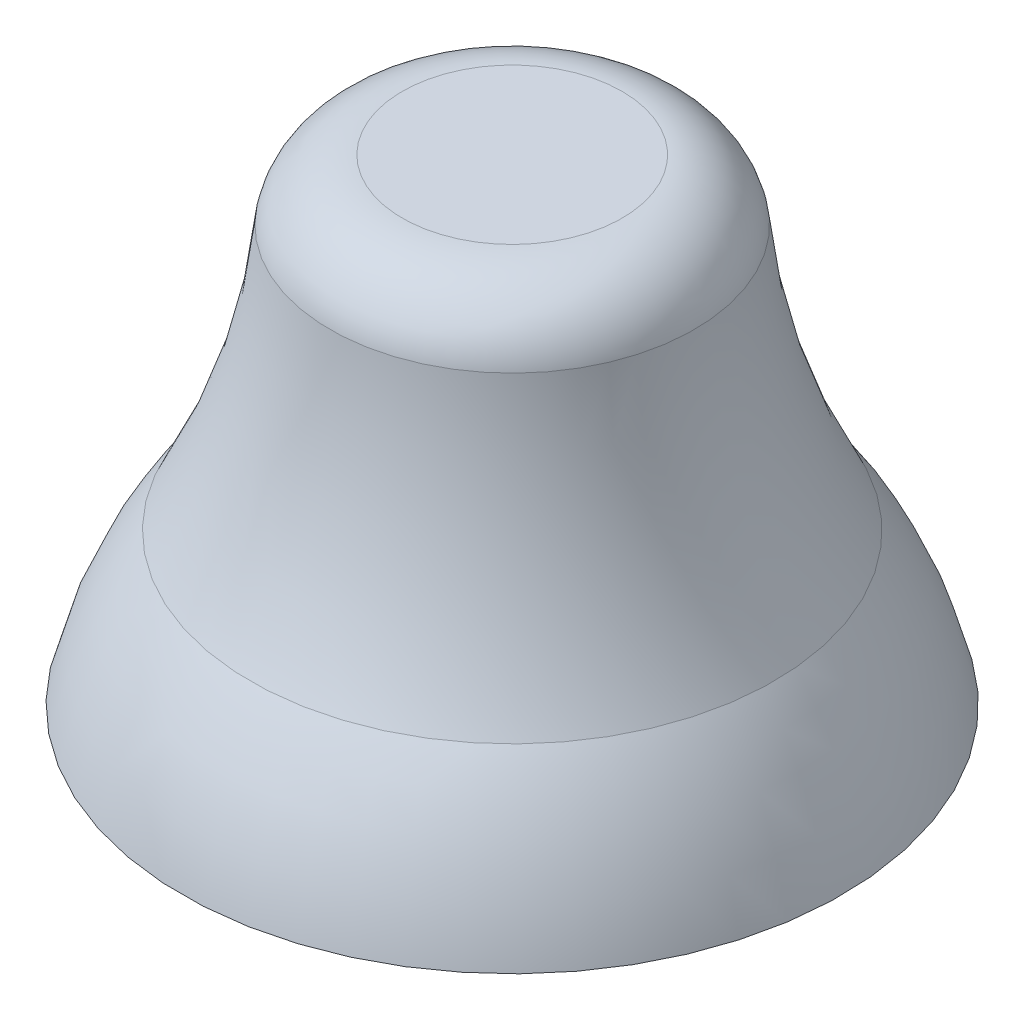
ISO-10303-21;
HEADER;
FILE_DESCRIPTION(('STEP AP214'),'2;1');
FILE_NAME('part.step','',(''),(''),'','','');
FILE_SCHEMA(('AUTOMOTIVE_DESIGN { 1 0 10303 214 1 1 1 1 }'));
ENDSEC;
DATA;
#1=APPLICATION_CONTEXT('core data for automotive mechanical design processes');
#2=APPLICATION_PROTOCOL_DEFINITION('international standard','automotive_design',2000,#1);
#3=PRODUCT_CONTEXT('',#1,'mechanical');
#4=PRODUCT('Part','Part','',(#3));
#5=PRODUCT_RELATED_PRODUCT_CATEGORY('part','',(#4));
#6=PRODUCT_DEFINITION_FORMATION('','',#4);
#7=PRODUCT_DEFINITION_CONTEXT('part definition',#1,'design');
#8=PRODUCT_DEFINITION('design','',#6,#7);
#9=PRODUCT_DEFINITION_SHAPE('','',#8);
#10=(LENGTH_UNIT() NAMED_UNIT(*) SI_UNIT(.MILLI.,.METRE.));
#11=(NAMED_UNIT(*) PLANE_ANGLE_UNIT() SI_UNIT($,.RADIAN.));
#12=(NAMED_UNIT(*) SI_UNIT($,.STERADIAN.) SOLID_ANGLE_UNIT());
#13=UNCERTAINTY_MEASURE_WITH_UNIT(LENGTH_MEASURE(1.E-05),#10,'distance_accuracy_value','');
#14=(GEOMETRIC_REPRESENTATION_CONTEXT(3) GLOBAL_UNCERTAINTY_ASSIGNED_CONTEXT((#13)) GLOBAL_UNIT_ASSIGNED_CONTEXT((#10,
#11,#12)) REPRESENTATION_CONTEXT('',''));
#15=CARTESIAN_POINT('',(0.,0.,0.));
#16=DIRECTION('',(0.,0.,1.));
#17=DIRECTION('',(1.,0.,0.));
#18=AXIS2_PLACEMENT_3D('',#15,#16,#17);
#19=CARTESIAN_POINT('',(0.,0.,0.));
#20=DIRECTION('',(0.,-1.,0.));
#21=DIRECTION('',(0.,0.,-1.));
#22=AXIS2_PLACEMENT_3D('',#19,#20,#21);
#23=PLANE('',#22);
#24=CARTESIAN_POINT('',(0.,0.,0.));
#25=DIRECTION('',(0.,-1.,0.));
#26=DIRECTION('',(0.,0.,-1.));
#27=AXIS2_PLACEMENT_3D('',#24,#25,#26);
#28=CIRCLE('',#27,0.9);
#29=CARTESIAN_POINT('',(0.,0.,-0.9));
#30=VERTEX_POINT('',#29);
#31=EDGE_CURVE('E10',#30,#30,#28,.T.);
#32=ORIENTED_EDGE('',*,*,#31,.T.);
#33=EDGE_LOOP('',(#32));
#34=FACE_BOUND('',#33,.T.);
#35=ADVANCED_FACE('F33',(#34),#23,.T.);
#36=CARTESIAN_POINT('',(0.,-0.236957481956429,0.));
#37=DIRECTION('',(0.,-1.,0.));
#38=DIRECTION('',(0.,0.,-1.));
#39=AXIS2_PLACEMENT_3D('',#36,#37,#38);
#40=DEGENERATE_TOROIDAL_SURFACE('',#39,0.174174637451876,1.1,.F.);
#41=CARTESIAN_POINT('',(0.,0.412,0.));
#42=DIRECTION('',(0.,-1.,0.));
#43=DIRECTION('',(0.,0.,-1.));
#44=AXIS2_PLACEMENT_3D('',#41,#42,#43);
#45=CIRCLE('',#44,0.714);
#46=CARTESIAN_POINT('',(0.,0.412,-0.714));
#47=VERTEX_POINT('',#46);
#48=EDGE_CURVE('E39',#47,#47,#45,.T.);
#49=ORIENTED_EDGE('',*,*,#48,.T.);
#50=EDGE_LOOP('',(#49));
#51=FACE_BOUND('',#50,.T.);
#52=ORIENTED_EDGE('',*,*,#31,.F.);
#53=EDGE_LOOP('',(#52));
#54=FACE_BOUND('',#53,.T.);
#55=ADVANCED_FACE('F65',(#51,#54),#40,.F.);
#56=CARTESIAN_POINT('',(0.,1.30900136379555,0.));
#57=DIRECTION('',(0.,-1.,0.));
#58=DIRECTION('',(0.,0.,-1.));
#59=AXIS2_PLACEMENT_3D('',#56,#57,#58);
#60=TOROIDAL_SURFACE('',#59,2.38892941742299,1.9);
#61=CARTESIAN_POINT('',(0.,1.135,0.));
#62=DIRECTION('',(0.,-1.,0.));
#63=DIRECTION('',(0.,0.,-1.));
#64=AXIS2_PLACEMENT_3D('',#61,#62,#63);
#65=CIRCLE('',#64,0.496913686675152);
#66=CARTESIAN_POINT('',(0.,1.135,-0.496913686675152));
#67=VERTEX_POINT('',#66);
#68=EDGE_CURVE('E43',#67,#67,#65,.T.);
#69=ORIENTED_EDGE('',*,*,#68,.T.);
#70=EDGE_LOOP('',(#69));
#71=FACE_BOUND('',#70,.T.);
#72=ORIENTED_EDGE('',*,*,#48,.F.);
#73=EDGE_LOOP('',(#72));
#74=FACE_BOUND('',#73,.T.);
#75=ADVANCED_FACE('F62',(#71,#74),#60,.F.);
#76=CARTESIAN_POINT('',(0.,1.1,0.));
#77=DIRECTION('',(0.,-1.,0.));
#78=DIRECTION('',(0.,0.,-1.));
#79=AXIS2_PLACEMENT_3D('',#76,#77,#78);
#80=TOROIDAL_SURFACE('',#79,0.3,0.2);
#81=CARTESIAN_POINT('',(0.,1.3,0.));
#82=DIRECTION('',(0.,-1.,0.));
#83=DIRECTION('',(0.,0.,-1.));
#84=AXIS2_PLACEMENT_3D('',#81,#82,#83);
#85=CIRCLE('',#84,0.3);
#86=CARTESIAN_POINT('',(0.,1.3,-0.3));
#87=VERTEX_POINT('',#86);
#88=EDGE_CURVE('E47',#87,#87,#85,.T.);
#89=ORIENTED_EDGE('',*,*,#88,.T.);
#90=EDGE_LOOP('',(#89));
#91=FACE_BOUND('',#90,.T.);
#92=ORIENTED_EDGE('',*,*,#68,.F.);
#93=EDGE_LOOP('',(#92));
#94=FACE_BOUND('',#93,.T.);
#95=ADVANCED_FACE('F53',(#91,#94),#80,.T.);
#96=CARTESIAN_POINT('',(0.,1.3,0.));
#97=DIRECTION('',(0.,1.,0.));
#98=DIRECTION('',(0.,0.,1.));
#99=AXIS2_PLACEMENT_3D('',#96,#97,#98);
#100=PLANE('',#99);
#101=ORIENTED_EDGE('',*,*,#88,.F.);
#102=EDGE_LOOP('',(#101));
#103=FACE_BOUND('',#102,.T.);
#104=ADVANCED_FACE('F56',(#103),#100,.T.);
#105=CLOSED_SHELL('',(#35,#55,#75,#95,#104));
#106=MANIFOLD_SOLID_BREP('B2',#105);
#107=ADVANCED_BREP_SHAPE_REPRESENTATION('',(#18,#106),#14);
#108=SHAPE_DEFINITION_REPRESENTATION(#9,#107);
ENDSEC;
END-ISO-10303-21;
